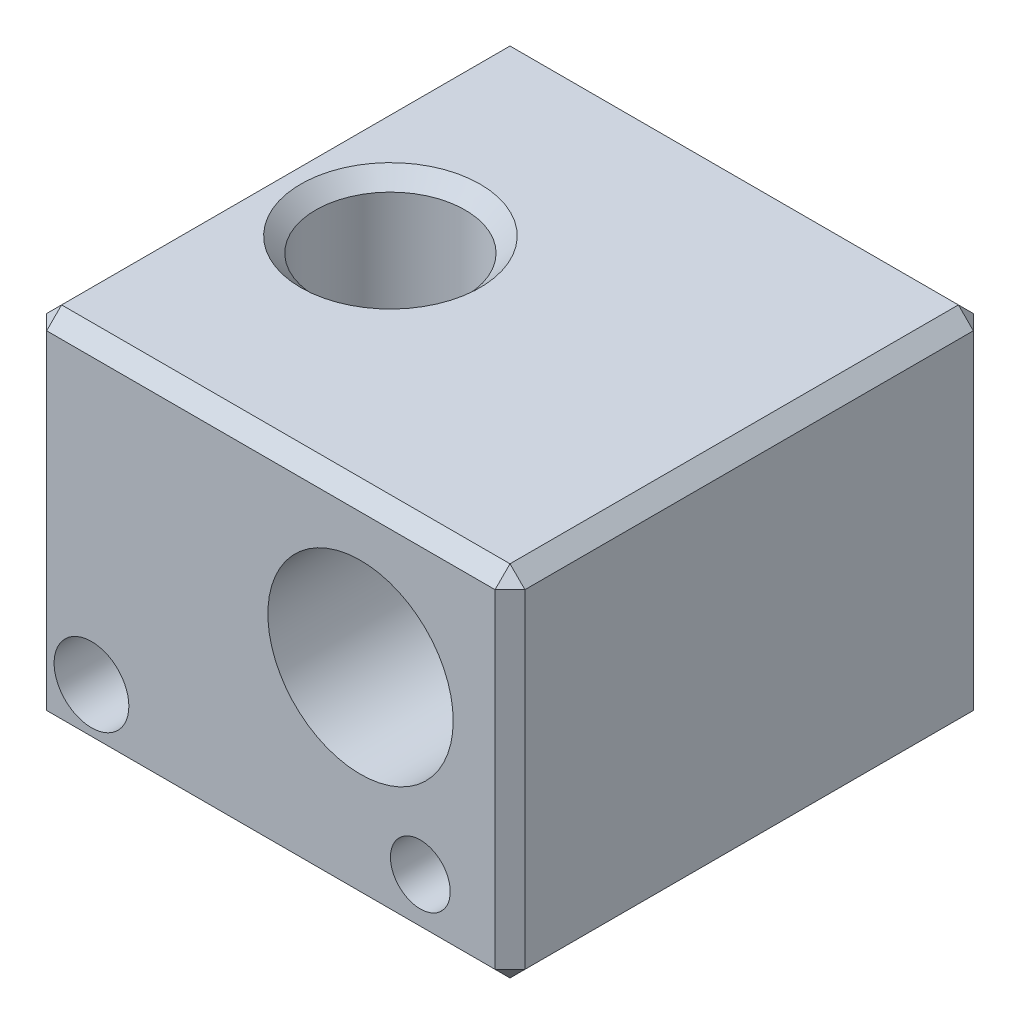
ISO-10303-21;
HEADER;
FILE_DESCRIPTION(('STEP AP214'),'2;1');
FILE_NAME('part.step','',(''),(''),'','','');
FILE_SCHEMA(('AUTOMOTIVE_DESIGN { 1 0 10303 214 1 1 1 1 }'));
ENDSEC;
DATA;
#1=APPLICATION_CONTEXT('core data for automotive mechanical design processes');
#2=APPLICATION_PROTOCOL_DEFINITION('international standard','automotive_design',2000,#1);
#3=PRODUCT_CONTEXT('',#1,'mechanical');
#4=PRODUCT('Part','Part','',(#3));
#5=PRODUCT_RELATED_PRODUCT_CATEGORY('part','',(#4));
#6=PRODUCT_DEFINITION_FORMATION('','',#4);
#7=PRODUCT_DEFINITION_CONTEXT('part definition',#1,'design');
#8=PRODUCT_DEFINITION('design','',#6,#7);
#9=PRODUCT_DEFINITION_SHAPE('','',#8);
#10=(LENGTH_UNIT() NAMED_UNIT(*) SI_UNIT(.MILLI.,.METRE.));
#11=(NAMED_UNIT(*) PLANE_ANGLE_UNIT() SI_UNIT($,.RADIAN.));
#12=(NAMED_UNIT(*) SI_UNIT($,.STERADIAN.) SOLID_ANGLE_UNIT());
#13=UNCERTAINTY_MEASURE_WITH_UNIT(LENGTH_MEASURE(1.E-05),#10,'distance_accuracy_value','');
#14=(GEOMETRIC_REPRESENTATION_CONTEXT(3) GLOBAL_UNCERTAINTY_ASSIGNED_CONTEXT((#13)) GLOBAL_UNIT_ASSIGNED_CONTEXT((#10,
#11,#12)) REPRESENTATION_CONTEXT('',''));
#15=CARTESIAN_POINT('',(0.,0.,0.));
#16=DIRECTION('',(0.,0.,1.));
#17=DIRECTION('',(1.,0.,0.));
#18=AXIS2_PLACEMENT_3D('',#15,#16,#17);
#19=CARTESIAN_POINT('',(-8.,12.,8.));
#20=DIRECTION('',(0.,0.,-1.));
#21=DIRECTION('',(-1.,0.,0.));
#22=AXIS2_PLACEMENT_3D('',#19,#20,#21);
#23=PLANE('',#22);
#24=DIRECTION('',(0.,-1.,0.));
#25=VECTOR('',#24,1.);
#26=CARTESIAN_POINT('',(-7.49999999999999,0.,8.));
#27=LINE('',#26,#25);
#28=CARTESIAN_POINT('',(-7.49999999999999,11.5,8.));
#29=VERTEX_POINT('',#28);
#30=CARTESIAN_POINT('',(-7.49999999999999,0.500000000000004,8.));
#31=VERTEX_POINT('',#30);
#32=EDGE_CURVE('E365',#29,#31,#27,.T.);
#33=ORIENTED_EDGE('',*,*,#32,.T.);
#34=DIRECTION('',(1.,0.,0.));
#35=VECTOR('',#34,1.);
#36=CARTESIAN_POINT('',(-8.,0.500000000000004,8.));
#37=LINE('',#36,#35);
#38=CARTESIAN_POINT('',(7.5,0.500000000000004,8.));
#39=VERTEX_POINT('',#38);
#40=EDGE_CURVE('E373',#31,#39,#37,.T.);
#41=ORIENTED_EDGE('',*,*,#40,.T.);
#42=DIRECTION('',(0.,1.,0.));
#43=VECTOR('',#42,1.);
#44=CARTESIAN_POINT('',(7.5,12.,8.));
#45=LINE('',#44,#43);
#46=CARTESIAN_POINT('',(7.5,11.5,8.));
#47=VERTEX_POINT('',#46);
#48=EDGE_CURVE('E355',#39,#47,#45,.T.);
#49=ORIENTED_EDGE('',*,*,#48,.T.);
#50=DIRECTION('',(-1.,0.,0.));
#51=VECTOR('',#50,1.);
#52=CARTESIAN_POINT('',(-8.,11.5,8.));
#53=LINE('',#52,#51);
#54=EDGE_CURVE('E361',#47,#29,#53,.T.);
#55=ORIENTED_EDGE('',*,*,#54,.T.);
#56=EDGE_LOOP('',(#33,#41,#49,#55));
#57=FACE_BOUND('',#56,.T.);
#58=CARTESIAN_POINT('',(-6.,2.,8.));
#59=DIRECTION('',(0.,0.,1.));
#60=DIRECTION('',(1.,0.,0.));
#61=AXIS2_PLACEMENT_3D('',#58,#59,#60);
#62=CIRCLE('',#61,1.25);
#63=CARTESIAN_POINT('',(-4.75,2.,8.));
#64=VERTEX_POINT('',#63);
#65=EDGE_CURVE('E233',#64,#64,#62,.T.);
#66=ORIENTED_EDGE('',*,*,#65,.F.);
#67=EDGE_LOOP('',(#66));
#68=FACE_BOUND('',#67,.T.);
#69=CARTESIAN_POINT('',(5.,2.,8.));
#70=DIRECTION('',(0.,0.,1.));
#71=DIRECTION('',(1.,0.,0.));
#72=AXIS2_PLACEMENT_3D('',#69,#70,#71);
#73=CIRCLE('',#72,1.);
#74=CARTESIAN_POINT('',(6.,2.,8.));
#75=VERTEX_POINT('',#74);
#76=EDGE_CURVE('E430',#75,#75,#73,.T.);
#77=ORIENTED_EDGE('',*,*,#76,.F.);
#78=EDGE_LOOP('',(#77));
#79=FACE_BOUND('',#78,.T.);
#80=CARTESIAN_POINT('',(3.,7.,8.));
#81=DIRECTION('',(0.,0.,1.));
#82=DIRECTION('',(1.,0.,0.));
#83=AXIS2_PLACEMENT_3D('',#80,#81,#82);
#84=CIRCLE('',#83,3.1);
#85=CARTESIAN_POINT('',(6.1,7.,8.));
#86=VERTEX_POINT('',#85);
#87=EDGE_CURVE('E424',#86,#86,#84,.T.);
#88=ORIENTED_EDGE('',*,*,#87,.F.);
#89=EDGE_LOOP('',(#88));
#90=FACE_BOUND('',#89,.T.);
#91=ADVANCED_FACE('F44',(#57,#68,#79,#90),#23,.F.);
#92=CARTESIAN_POINT('',(8.,12.,8.));
#93=DIRECTION('',(-1.,0.,0.));
#94=DIRECTION('',(0.,0.,1.));
#95=AXIS2_PLACEMENT_3D('',#92,#93,#94);
#96=PLANE('',#95);
#97=DIRECTION('',(0.,0.,1.));
#98=VECTOR('',#97,1.);
#99=CARTESIAN_POINT('',(8.,11.5,8.));
#100=LINE('',#99,#98);
#101=CARTESIAN_POINT('',(8.,11.5,-7.5));
#102=VERTEX_POINT('',#101);
#103=CARTESIAN_POINT('',(8.,11.5,7.5));
#104=VERTEX_POINT('',#103);
#105=EDGE_CURVE('E375',#102,#104,#100,.T.);
#106=ORIENTED_EDGE('',*,*,#105,.T.);
#107=DIRECTION('',(0.,-1.,0.));
#108=VECTOR('',#107,1.);
#109=CARTESIAN_POINT('',(8.,12.,7.5));
#110=LINE('',#109,#108);
#111=CARTESIAN_POINT('',(8.,0.5,7.5));
#112=VERTEX_POINT('',#111);
#113=EDGE_CURVE('E357',#104,#112,#110,.T.);
#114=ORIENTED_EDGE('',*,*,#113,.T.);
#115=DIRECTION('',(0.,0.,-1.));
#116=VECTOR('',#115,1.);
#117=CARTESIAN_POINT('',(8.,0.5,8.));
#118=LINE('',#117,#116);
#119=CARTESIAN_POINT('',(8.,0.5,-7.5));
#120=VERTEX_POINT('',#119);
#121=EDGE_CURVE('E379',#112,#120,#118,.T.);
#122=ORIENTED_EDGE('',*,*,#121,.T.);
#123=DIRECTION('',(0.,1.,0.));
#124=VECTOR('',#123,1.);
#125=CARTESIAN_POINT('',(8.,12.,-7.5));
#126=LINE('',#125,#124);
#127=EDGE_CURVE('E377',#120,#102,#126,.T.);
#128=ORIENTED_EDGE('',*,*,#127,.T.);
#129=EDGE_LOOP('',(#106,#114,#122,#128));
#130=FACE_BOUND('',#129,.T.);
#131=ADVANCED_FACE('F265',(#130),#96,.F.);
#132=CARTESIAN_POINT('',(-8.,12.,-8.));
#133=DIRECTION('',(0.,0.,-1.));
#134=DIRECTION('',(-1.,0.,0.));
#135=AXIS2_PLACEMENT_3D('',#132,#133,#134);
#136=PLANE('',#135);
#137=DIRECTION('',(-1.,0.,0.));
#138=VECTOR('',#137,1.);
#139=CARTESIAN_POINT('',(-8.,0.500000000000004,-8.));
#140=LINE('',#139,#138);
#141=CARTESIAN_POINT('',(7.5,0.500000000000004,-8.));
#142=VERTEX_POINT('',#141);
#143=CARTESIAN_POINT('',(-7.49999999999999,0.500000000000004,-8.));
#144=VERTEX_POINT('',#143);
#145=EDGE_CURVE('E368',#142,#144,#140,.T.);
#146=ORIENTED_EDGE('',*,*,#145,.T.);
#147=DIRECTION('',(0.,1.,0.));
#148=VECTOR('',#147,1.);
#149=CARTESIAN_POINT('',(-7.49999999999999,12.,-8.));
#150=LINE('',#149,#148);
#151=CARTESIAN_POINT('',(-7.49999999999999,11.5,-8.));
#152=VERTEX_POINT('',#151);
#153=EDGE_CURVE('E363',#144,#152,#150,.T.);
#154=ORIENTED_EDGE('',*,*,#153,.T.);
#155=DIRECTION('',(1.,0.,0.));
#156=VECTOR('',#155,1.);
#157=CARTESIAN_POINT('',(-8.,11.5,-8.));
#158=LINE('',#157,#156);
#159=CARTESIAN_POINT('',(7.5,11.5,-8.));
#160=VERTEX_POINT('',#159);
#161=EDGE_CURVE('E394',#152,#160,#158,.T.);
#162=ORIENTED_EDGE('',*,*,#161,.T.);
#163=DIRECTION('',(0.,-1.,0.));
#164=VECTOR('',#163,1.);
#165=CARTESIAN_POINT('',(7.5,0.,-8.));
#166=LINE('',#165,#164);
#167=EDGE_CURVE('E396',#160,#142,#166,.T.);
#168=ORIENTED_EDGE('',*,*,#167,.T.);
#169=EDGE_LOOP('',(#146,#154,#162,#168));
#170=FACE_BOUND('',#169,.T.);
#171=CARTESIAN_POINT('',(5.,2.,-8.));
#172=DIRECTION('',(0.,0.,1.));
#173=DIRECTION('',(1.,0.,0.));
#174=AXIS2_PLACEMENT_3D('',#171,#172,#173);
#175=CIRCLE('',#174,1.);
#176=CARTESIAN_POINT('',(6.,2.,-8.));
#177=VERTEX_POINT('',#176);
#178=EDGE_CURVE('E427',#177,#177,#175,.T.);
#179=ORIENTED_EDGE('',*,*,#178,.T.);
#180=EDGE_LOOP('',(#179));
#181=FACE_BOUND('',#180,.T.);
#182=CARTESIAN_POINT('',(3.,7.,-8.));
#183=DIRECTION('',(0.,0.,1.));
#184=DIRECTION('',(1.,0.,0.));
#185=AXIS2_PLACEMENT_3D('',#182,#183,#184);
#186=CIRCLE('',#185,3.1);
#187=CARTESIAN_POINT('',(6.1,7.,-8.));
#188=VERTEX_POINT('',#187);
#189=EDGE_CURVE('E154',#188,#188,#186,.T.);
#190=ORIENTED_EDGE('',*,*,#189,.T.);
#191=EDGE_LOOP('',(#190));
#192=FACE_BOUND('',#191,.T.);
#193=ADVANCED_FACE('F271',(#170,#181,#192),#136,.T.);
#194=CARTESIAN_POINT('',(-8.,12.,8.));
#195=DIRECTION('',(-1.,0.,0.));
#196=DIRECTION('',(0.,0.,1.));
#197=AXIS2_PLACEMENT_3D('',#194,#195,#196);
#198=PLANE('',#197);
#199=DIRECTION('',(0.,-1.,0.));
#200=VECTOR('',#199,1.);
#201=CARTESIAN_POINT('',(-8.,12.,-7.5));
#202=LINE('',#201,#200);
#203=CARTESIAN_POINT('',(-8.,11.5,-7.5));
#204=VERTEX_POINT('',#203);
#205=CARTESIAN_POINT('',(-8.,0.500000000000004,-7.5));
#206=VERTEX_POINT('',#205);
#207=EDGE_CURVE('E389',#204,#206,#202,.T.);
#208=ORIENTED_EDGE('',*,*,#207,.T.);
#209=DIRECTION('',(0.,0.,1.));
#210=VECTOR('',#209,1.);
#211=CARTESIAN_POINT('',(-8.,0.500000000000004,8.));
#212=LINE('',#211,#210);
#213=CARTESIAN_POINT('',(-8.,0.500000000000004,7.5));
#214=VERTEX_POINT('',#213);
#215=EDGE_CURVE('E160',#206,#214,#212,.T.);
#216=ORIENTED_EDGE('',*,*,#215,.T.);
#217=DIRECTION('',(0.,1.,0.));
#218=VECTOR('',#217,1.);
#219=CARTESIAN_POINT('',(-8.,12.,7.5));
#220=LINE('',#219,#218);
#221=CARTESIAN_POINT('',(-8.,11.5,7.5));
#222=VERTEX_POINT('',#221);
#223=EDGE_CURVE('E403',#214,#222,#220,.T.);
#224=ORIENTED_EDGE('',*,*,#223,.T.);
#225=DIRECTION('',(0.,0.,-1.));
#226=VECTOR('',#225,1.);
#227=CARTESIAN_POINT('',(-8.,11.5,8.));
#228=LINE('',#227,#226);
#229=EDGE_CURVE('E405',#222,#204,#228,.T.);
#230=ORIENTED_EDGE('',*,*,#229,.T.);
#231=EDGE_LOOP('',(#208,#216,#224,#230));
#232=FACE_BOUND('',#231,.T.);
#233=ADVANCED_FACE('F465',(#232),#198,.T.);
#234=CARTESIAN_POINT('',(0.,12.,0.));
#235=DIRECTION('',(0.,1.,0.));
#236=DIRECTION('',(0.,0.,1.));
#237=AXIS2_PLACEMENT_3D('',#234,#235,#236);
#238=PLANE('',#237);
#239=DIRECTION('',(-1.,0.,0.));
#240=VECTOR('',#239,1.);
#241=CARTESIAN_POINT('',(0.,12.,-7.5));
#242=LINE('',#241,#240);
#243=CARTESIAN_POINT('',(7.5,12.,-7.5));
#244=VERTEX_POINT('',#243);
#245=CARTESIAN_POINT('',(-7.5,12.,-7.5));
#246=VERTEX_POINT('',#245);
#247=EDGE_CURVE('E53',#244,#246,#242,.T.);
#248=ORIENTED_EDGE('',*,*,#247,.T.);
#249=DIRECTION('',(0.,0.,1.));
#250=VECTOR('',#249,1.);
#251=CARTESIAN_POINT('',(-7.5,12.,0.));
#252=LINE('',#251,#250);
#253=CARTESIAN_POINT('',(-7.5,12.,7.5));
#254=VERTEX_POINT('',#253);
#255=EDGE_CURVE('E13',#246,#254,#252,.T.);
#256=ORIENTED_EDGE('',*,*,#255,.T.);
#257=DIRECTION('',(1.,0.,0.));
#258=VECTOR('',#257,1.);
#259=CARTESIAN_POINT('',(8.,12.,7.5));
#260=LINE('',#259,#258);
#261=CARTESIAN_POINT('',(7.5,12.,7.5));
#262=VERTEX_POINT('',#261);
#263=EDGE_CURVE('E385',#254,#262,#260,.T.);
#264=ORIENTED_EDGE('',*,*,#263,.T.);
#265=DIRECTION('',(0.,0.,-1.));
#266=VECTOR('',#265,1.);
#267=CARTESIAN_POINT('',(7.5,12.,-8.));
#268=LINE('',#267,#266);
#269=EDGE_CURVE('E64',#262,#244,#268,.T.);
#270=ORIENTED_EDGE('',*,*,#269,.T.);
#271=EDGE_LOOP('',(#248,#256,#264,#270));
#272=FACE_BOUND('',#271,.T.);
#273=CARTESIAN_POINT('',(-4.,12.,0.));
#274=DIRECTION('',(0.,1.,0.));
#275=DIRECTION('',(0.,0.,1.));
#276=AXIS2_PLACEMENT_3D('',#273,#274,#275);
#277=CIRCLE('',#276,2.99999999999999);
#278=CARTESIAN_POINT('',(-4.,12.,2.99999999999999));
#279=VERTEX_POINT('',#278);
#280=EDGE_CURVE('E382',#279,#279,#277,.F.);
#281=ORIENTED_EDGE('',*,*,#280,.T.);
#282=EDGE_LOOP('',(#281));
#283=FACE_BOUND('',#282,.T.);
#284=ADVANCED_FACE('F458',(#272,#283),#238,.T.);
#285=CARTESIAN_POINT('',(0.,0.,0.));
#286=DIRECTION('',(0.,1.,0.));
#287=DIRECTION('',(0.,0.,1.));
#288=AXIS2_PLACEMENT_3D('',#285,#286,#287);
#289=PLANE('',#288);
#290=CARTESIAN_POINT('',(-4.,0.,0.));
#291=DIRECTION('',(0.,1.,0.));
#292=DIRECTION('',(0.,0.,1.));
#293=AXIS2_PLACEMENT_3D('',#290,#291,#292);
#294=CIRCLE('',#293,3.);
#295=CARTESIAN_POINT('',(-4.,0.,3.));
#296=VERTEX_POINT('',#295);
#297=EDGE_CURVE('E415',#296,#296,#294,.T.);
#298=ORIENTED_EDGE('',*,*,#297,.T.);
#299=EDGE_LOOP('',(#298));
#300=FACE_BOUND('',#299,.T.);
#301=CARTESIAN_POINT('',(2.,0.,0.));
#302=DIRECTION('',(0.,1.,0.));
#303=DIRECTION('',(0.,0.,1.));
#304=AXIS2_PLACEMENT_3D('',#301,#302,#303);
#305=CIRCLE('',#304,1.75);
#306=CARTESIAN_POINT('',(2.,0.,1.75));
#307=VERTEX_POINT('',#306);
#308=EDGE_CURVE('E418',#307,#307,#305,.T.);
#309=ORIENTED_EDGE('',*,*,#308,.T.);
#310=EDGE_LOOP('',(#309));
#311=FACE_BOUND('',#310,.T.);
#312=DIRECTION('',(1.,0.,0.));
#313=VECTOR('',#312,1.);
#314=CARTESIAN_POINT('',(8.,0.,-7.5));
#315=LINE('',#314,#313);
#316=CARTESIAN_POINT('',(-7.5,0.,-7.5));
#317=VERTEX_POINT('',#316);
#318=CARTESIAN_POINT('',(7.5,0.,-7.5));
#319=VERTEX_POINT('',#318);
#320=EDGE_CURVE('E136',#317,#319,#315,.T.);
#321=ORIENTED_EDGE('',*,*,#320,.T.);
#322=DIRECTION('',(0.,0.,1.));
#323=VECTOR('',#322,1.);
#324=CARTESIAN_POINT('',(7.5,0.,0.));
#325=LINE('',#324,#323);
#326=CARTESIAN_POINT('',(7.5,0.,7.5));
#327=VERTEX_POINT('',#326);
#328=EDGE_CURVE('E421',#319,#327,#325,.T.);
#329=ORIENTED_EDGE('',*,*,#328,.T.);
#330=DIRECTION('',(-1.,0.,0.));
#331=VECTOR('',#330,1.);
#332=CARTESIAN_POINT('',(0.,0.,7.5));
#333=LINE('',#332,#331);
#334=CARTESIAN_POINT('',(-7.5,0.,7.5));
#335=VERTEX_POINT('',#334);
#336=EDGE_CURVE('E138',#327,#335,#333,.T.);
#337=ORIENTED_EDGE('',*,*,#336,.T.);
#338=DIRECTION('',(0.,0.,-1.));
#339=VECTOR('',#338,1.);
#340=CARTESIAN_POINT('',(-7.5,0.,-8.));
#341=LINE('',#340,#339);
#342=EDGE_CURVE('E132',#335,#317,#341,.T.);
#343=ORIENTED_EDGE('',*,*,#342,.T.);
#344=EDGE_LOOP('',(#321,#329,#337,#343));
#345=FACE_BOUND('',#344,.T.);
#346=ADVANCED_FACE('F134',(#300,#311,#345),#289,.F.);
#347=CARTESIAN_POINT('',(3.,7.,-8.));
#348=DIRECTION('',(0.,0.,1.));
#349=DIRECTION('',(1.,0.,0.));
#350=AXIS2_PLACEMENT_3D('',#347,#348,#349);
#351=CYLINDRICAL_SURFACE('',#350,3.1);
#352=CARTESIAN_POINT('',(2.,4.06571984977576,-1.25));
#353=CARTESIAN_POINT('',(2.06412407102761,4.04386931657047,-1.24999682356544));
#354=CARTESIAN_POINT('',(2.1290323605544,4.02411324985325,-1.24504633684303));
#355=CARTESIAN_POINT('',(2.25852514450525,3.98923249124023,-1.22473081712279));
#356=CARTESIAN_POINT('',(2.32310928391037,3.97411209996811,-1.20935615557821));
#357=CARTESIAN_POINT('',(2.44989951240688,3.94851243111399,-1.16813357100094));
#358=CARTESIAN_POINT('',(2.5121031224863,3.93803787752112,-1.14227503862974));
#359=CARTESIAN_POINT('',(2.63195571275444,3.92132984840443,-1.08059009030169));
#360=CARTESIAN_POINT('',(2.68960522979696,3.9150958723238,-1.04476485151625));
#361=CARTESIAN_POINT('',(2.79749646548957,3.9061553785297,-0.964844569883464));
#362=CARTESIAN_POINT('',(2.84785468706466,3.90338624247298,-0.920913307988026));
#363=CARTESIAN_POINT('',(2.94096515404917,3.9002113379841,-0.825546991201818));
#364=CARTESIAN_POINT('',(2.98371611790489,3.89980596739803,-0.77411067462625));
#365=CARTESIAN_POINT('',(3.06159260293196,3.90035946609992,-0.663497060760644));
#366=CARTESIAN_POINT('',(3.09645925371717,3.90135848340574,-0.604137697597038));
#367=CARTESIAN_POINT('',(3.15599100394901,3.90378325578923,-0.48051332323618));
#368=CARTESIAN_POINT('',(3.18065507855612,3.90520905371185,-0.41624781998927));
#369=CARTESIAN_POINT('',(3.219563460487,3.90772172802315,-0.283004227305716));
#370=CARTESIAN_POINT('',(3.23355335949016,3.90879999521813,-0.213951486933704));
#371=CARTESIAN_POINT('',(3.24975342466547,3.91006624436077,-0.0744708002820152));
#372=CARTESIAN_POINT('',(3.25196372633312,3.91025423654886,-0.0040428698298939));
#373=CARTESIAN_POINT('',(3.24454584579713,3.90965852729883,0.13610331981758));
#374=CARTESIAN_POINT('',(3.23493084752302,3.90887590797932,0.205822282120605));
#375=CARTESIAN_POINT('',(3.20416096316388,3.90669215451381,0.342658473349358));
#376=CARTESIAN_POINT('',(3.18300525336871,3.90529097621996,0.409775516198639));
#377=CARTESIAN_POINT('',(3.12971705925274,3.90260076032698,0.539600864597366));
#378=CARTESIAN_POINT('',(3.09757104261829,3.90131186344619,0.602303619527018));
#379=CARTESIAN_POINT('',(3.02320544748315,3.89986461575388,0.721443742705734));
#380=CARTESIAN_POINT('',(2.98098576274907,3.89970627686539,0.777881044872323));
#381=CARTESIAN_POINT('',(2.88783342606414,3.90168164861602,0.882695629692789));
#382=CARTESIAN_POINT('',(2.83692789470841,3.90380833082803,0.931097102225148));
#383=CARTESIAN_POINT('',(2.72789903274865,3.91148275042813,1.01859946114047));
#384=CARTESIAN_POINT('',(2.6697779427384,3.91702942794207,1.0577032237314));
#385=CARTESIAN_POINT('',(2.55012644860688,3.93224260272356,1.12446031488305));
#386=CARTESIAN_POINT('',(2.48875355593523,3.9417786318946,1.15242580114432));
#387=CARTESIAN_POINT('',(2.36312125667163,3.96545446304068,1.19795912574914));
#388=CARTESIAN_POINT('',(2.29886232190712,3.97959351483077,1.21552865707629));
#389=CARTESIAN_POINT('',(2.17069358533456,4.01226682493206,1.23997912488614));
#390=CARTESIAN_POINT('',(2.10679724119453,4.03072012533362,1.24704113706527));
#391=CARTESIAN_POINT('',(1.98004597127627,4.07183711455998,1.25145005951004));
#392=CARTESIAN_POINT('',(1.91719133547124,4.09450195497261,1.24879430886528));
#393=CARTESIAN_POINT('',(1.79039996352613,4.14486637335437,1.23404889696496));
#394=CARTESIAN_POINT('',(1.72661340015781,4.17278229677925,1.22141881599695));
#395=CARTESIAN_POINT('',(1.60309462789989,4.23172480365729,1.18704722608764));
#396=CARTESIAN_POINT('',(1.54336344063695,4.26275216610093,1.16530343105146));
#397=CARTESIAN_POINT('',(1.42117063361051,4.33113821293562,1.11019217671031));
#398=CARTESIAN_POINT('',(1.35939678232038,4.36879094402457,1.07566592104613));
#399=CARTESIAN_POINT('',(1.24282899693574,4.4451575339971,0.997068324896723));
#400=CARTESIAN_POINT('',(1.18804788503108,4.48387318839118,0.952979839015347));
#401=CARTESIAN_POINT('',(1.07981131798573,4.5652493581044,0.84973208913941));
#402=CARTESIAN_POINT('',(1.02740262887541,4.60778841664885,0.78937125648153));
#403=CARTESIAN_POINT('',(0.933940511899614,4.68803781259185,0.657652699139252));
#404=CARTESIAN_POINT('',(0.892858403867074,4.72576021366949,0.58632347533955));
#405=CARTESIAN_POINT('',(0.837584924562768,4.77855333774515,0.462557639917995));
#406=CARTESIAN_POINT('',(0.819123133548135,4.79676287087563,0.413367344271981));
#407=CARTESIAN_POINT('',(0.78826980528795,4.82773679133903,0.311499179493662));
#408=CARTESIAN_POINT('',(0.77586854424242,4.84050989685295,0.25882705197902));
#409=CARTESIAN_POINT('',(0.757881546309418,4.85918640303962,0.150576807086338));
#410=CARTESIAN_POINT('',(0.752359461653582,4.86502562241385,0.0949764403431551));
#411=CARTESIAN_POINT('',(0.748865472828148,4.86870869109976,-0.0167257193774438));
#412=CARTESIAN_POINT('',(0.75089069399976,4.86655558457313,-0.0728273133239362));
#413=CARTESIAN_POINT('',(0.761578516592351,4.85535245667867,-0.176640207564639));
#414=CARTESIAN_POINT('',(0.769401951034631,4.84717513891782,-0.224540654398175));
#415=CARTESIAN_POINT('',(0.790189830408191,4.82584267352125,-0.318052868932751));
#416=CARTESIAN_POINT('',(0.803158016152508,4.81268390412906,-0.363662944029742));
#417=CARTESIAN_POINT('',(0.840162649243759,4.77603236941032,-0.470880626168048));
#418=CARTESIAN_POINT('',(0.866560750198721,4.75052707780665,-0.530981431141114));
#419=CARTESIAN_POINT('',(0.927112096806266,4.69460608468315,-0.644654810619277));
#420=CARTESIAN_POINT('',(0.96128358816086,4.66417887978581,-0.698211562882469));
#421=CARTESIAN_POINT('',(1.04663268271053,4.59204167799534,-0.812383187083013));
#422=CARTESIAN_POINT('',(1.09990535564506,4.54952185264107,-0.870922323350582));
#423=CARTESIAN_POINT('',(1.21609478271498,4.46368107503741,-0.976818044097293));
#424=CARTESIAN_POINT('',(1.27901991633881,4.42035945574847,-1.02416482064182));
#425=CARTESIAN_POINT('',(1.41392776615344,4.33527163579194,-1.10694157287936));
#426=CARTESIAN_POINT('',(1.48596282556899,4.29351639302137,-1.14229794759976));
#427=CARTESIAN_POINT('',(1.63734346211578,4.21424966883542,-1.19894283194074));
#428=CARTESIAN_POINT('',(1.71666261513442,4.17672386857871,-1.22028006615794));
#429=CARTESIAN_POINT('',(1.83136793930619,4.12848715119251,-1.23902278442863));
#430=CARTESIAN_POINT('',(1.86466000756247,4.11516072866024,-1.2431091379948));
#431=CARTESIAN_POINT('',(1.93189370742814,4.08959773467645,-1.24859903306798));
#432=CARTESIAN_POINT('',(1.96583554893592,4.07736152287063,-1.25000169236203));
#433=CARTESIAN_POINT('',(2.,4.06571984977576,-1.25));
#434=B_SPLINE_CURVE_WITH_KNOTS('',3,(#352,#353,#354,#355,#356,#357,#358,#359,#360,#361,#362,
#363,#364,#365,#366,#367,#368,#369,#370,#371,#372,#373,#374,#375,#376,#377,#378,#379,#380,#381,
#382,#383,#384,#385,#386,#387,#388,#389,#390,#391,#392,#393,#394,#395,#396,#397,#398,#399,#400,
#401,#402,#403,#404,#405,#406,#407,#408,#409,#410,#411,#412,#413,#414,#415,#416,#417,#418,#419,
#420,#421,#422,#423,#424,#425,#426,#427,#428,#429,#430,#431,#432,#433),.UNSPECIFIED.,.T.,.F.,(4,
2,2,2,2,2,2,2,2,2,2,2,2,2,2,2,2,2,2,2,2,2,2,2,2,2,2,2,2,2,2,2,2,2,2,2,2,2,2,2,4),(0.,
0.203106901637013,0.406401664025732,0.609902669700279,0.813379649991945,1.01312353075626,
1.21290102950349,1.41850722043965,1.62413405931888,1.83452067354489,2.04490486778157,
2.25505471888995,2.46521957125866,2.67564413620872,2.88607092032087,3.09585230705912,
3.30556871411916,3.50890505804192,3.71220827947522,3.91196568210335,4.11177778624364,
4.32322687709546,4.53472903986192,4.77426968848165,5.01424344552382,5.28461256836008,
5.55429066399378,5.72053905381196,5.88651982393155,6.05402525513779,6.22146689248854,
6.36849795003851,6.51563611222958,6.72574116876292,6.93634456763189,7.20454767246493,
7.47298494124712,7.74304134015153,8.01215410127126,8.120331198527,8.2285438508205),.UNSPECIFIED.);
#435=CARTESIAN_POINT('',(2.,4.06571984977576,-1.25));
#436=VERTEX_POINT('',#435);
#437=EDGE_CURVE('E227',#436,#436,#434,.T.);
#438=ORIENTED_EDGE('',*,*,#437,.T.);
#439=EDGE_LOOP('',(#438));
#440=FACE_BOUND('',#439,.T.);
#441=ORIENTED_EDGE('',*,*,#189,.F.);
#442=EDGE_LOOP('',(#441));
#443=FACE_BOUND('',#442,.T.);
#444=ORIENTED_EDGE('',*,*,#87,.T.);
#445=EDGE_LOOP('',(#444));
#446=FACE_BOUND('',#445,.T.);
#447=ADVANCED_FACE('F448',(#440,#443,#446),#351,.F.);
#448=CARTESIAN_POINT('',(5.,2.,-8.));
#449=DIRECTION('',(0.,0.,1.));
#450=DIRECTION('',(1.,0.,0.));
#451=AXIS2_PLACEMENT_3D('',#448,#449,#450);
#452=CYLINDRICAL_SURFACE('',#451,1.);
#453=ORIENTED_EDGE('',*,*,#178,.F.);
#454=EDGE_LOOP('',(#453));
#455=FACE_BOUND('',#454,.T.);
#456=ORIENTED_EDGE('',*,*,#76,.T.);
#457=EDGE_LOOP('',(#456));
#458=FACE_BOUND('',#457,.T.);
#459=ADVANCED_FACE('F450',(#455,#458),#452,.F.);
#460=CARTESIAN_POINT('',(-6.,2.,3.5));
#461=DIRECTION('',(0.,0.,-1.));
#462=DIRECTION('',(-1.,0.,0.));
#463=AXIS2_PLACEMENT_3D('',#460,#461,#462);
#464=PLANE('',#463);
#465=CARTESIAN_POINT('',(-6.,2.,3.5));
#466=DIRECTION('',(0.,0.,1.));
#467=DIRECTION('',(1.,0.,0.));
#468=AXIS2_PLACEMENT_3D('',#465,#466,#467);
#469=CIRCLE('',#468,1.25);
#470=CARTESIAN_POINT('',(-4.75,2.,3.5));
#471=VERTEX_POINT('',#470);
#472=EDGE_CURVE('E238',#471,#471,#469,.T.);
#473=ORIENTED_EDGE('',*,*,#472,.T.);
#474=EDGE_LOOP('',(#473));
#475=FACE_BOUND('',#474,.T.);
#476=ADVANCED_FACE('F437',(#475),#464,.F.);
#477=CARTESIAN_POINT('',(-6.,2.,8.));
#478=DIRECTION('',(0.,0.,1.));
#479=DIRECTION('',(1.,0.,0.));
#480=AXIS2_PLACEMENT_3D('',#477,#478,#479);
#481=CYLINDRICAL_SURFACE('',#480,1.25);
#482=ORIENTED_EDGE('',*,*,#472,.F.);
#483=EDGE_LOOP('',(#482));
#484=FACE_BOUND('',#483,.T.);
#485=ORIENTED_EDGE('',*,*,#65,.T.);
#486=EDGE_LOOP('',(#485));
#487=FACE_BOUND('',#486,.T.);
#488=ADVANCED_FACE('F260',(#484,#487),#481,.F.);
#489=CARTESIAN_POINT('',(-4.,12.,0.));
#490=DIRECTION('',(0.,1.,0.));
#491=DIRECTION('',(0.,0.,1.));
#492=AXIS2_PLACEMENT_3D('',#489,#490,#491);
#493=CYLINDRICAL_SURFACE('',#492,2.49999999999999);
#494=CARTESIAN_POINT('',(-4.,0.500000000000007,0.));
#495=DIRECTION('',(0.,1.,0.));
#496=DIRECTION('',(0.,0.,1.));
#497=AXIS2_PLACEMENT_3D('',#494,#495,#496);
#498=CIRCLE('',#497,2.49999999999999);
#499=CARTESIAN_POINT('',(-4.,0.500000000000007,2.49999999999999));
#500=VERTEX_POINT('',#499);
#501=EDGE_CURVE('E409',#500,#500,#498,.F.);
#502=ORIENTED_EDGE('',*,*,#501,.T.);
#503=EDGE_LOOP('',(#502));
#504=FACE_BOUND('',#503,.T.);
#505=CARTESIAN_POINT('',(-4.,11.5,0.));
#506=DIRECTION('',(0.,1.,0.));
#507=DIRECTION('',(0.,0.,1.));
#508=AXIS2_PLACEMENT_3D('',#505,#506,#507);
#509=CIRCLE('',#508,2.49999999999999);
#510=CARTESIAN_POINT('',(-4.,11.5,2.49999999999999));
#511=VERTEX_POINT('',#510);
#512=EDGE_CURVE('E412',#511,#511,#509,.T.);
#513=ORIENTED_EDGE('',*,*,#512,.T.);
#514=EDGE_LOOP('',(#513));
#515=FACE_BOUND('',#514,.T.);
#516=ADVANCED_FACE('F251',(#504,#515),#493,.F.);
#517=CARTESIAN_POINT('',(2.,0.,0.));
#518=DIRECTION('',(0.,-1.,0.));
#519=DIRECTION('',(0.,0.,-1.));
#520=AXIS2_PLACEMENT_3D('',#517,#518,#519);
#521=CYLINDRICAL_SURFACE('',#520,1.25);
#522=CARTESIAN_POINT('',(2.,0.499999999999996,0.));
#523=DIRECTION('',(0.,1.,0.));
#524=DIRECTION('',(0.,0.,1.));
#525=AXIS2_PLACEMENT_3D('',#522,#523,#524);
#526=CIRCLE('',#525,1.25);
#527=CARTESIAN_POINT('',(2.,0.499999999999996,1.25));
#528=VERTEX_POINT('',#527);
#529=EDGE_CURVE('E407',#528,#528,#526,.F.);
#530=ORIENTED_EDGE('',*,*,#529,.T.);
#531=EDGE_LOOP('',(#530));
#532=FACE_BOUND('',#531,.T.);
#533=ORIENTED_EDGE('',*,*,#437,.F.);
#534=EDGE_LOOP('',(#533));
#535=FACE_BOUND('',#534,.T.);
#536=ADVANCED_FACE('F247',(#532,#535),#521,.F.);
#537=CARTESIAN_POINT('',(-4.,0.,0.));
#538=DIRECTION('',(0.,-1.,0.));
#539=DIRECTION('',(0.,0.,-1.));
#540=AXIS2_PLACEMENT_3D('',#537,#538,#539);
#541=CONICAL_SURFACE('',#540,3.,0.785398163397445);
#542=ORIENTED_EDGE('',*,*,#501,.F.);
#543=EDGE_LOOP('',(#542));
#544=FACE_BOUND('',#543,.T.);
#545=ORIENTED_EDGE('',*,*,#297,.F.);
#546=EDGE_LOOP('',(#545));
#547=FACE_BOUND('',#546,.T.);
#548=ADVANCED_FACE('F250',(#544,#547),#541,.F.);
#549=CARTESIAN_POINT('',(2.,0.499999999999996,0.));
#550=DIRECTION('',(0.,-1.,0.));
#551=DIRECTION('',(0.,0.,-1.));
#552=AXIS2_PLACEMENT_3D('',#549,#550,#551);
#553=CONICAL_SURFACE('',#552,1.25,0.785398163397451);
#554=ORIENTED_EDGE('',*,*,#308,.F.);
#555=EDGE_LOOP('',(#554));
#556=FACE_BOUND('',#555,.T.);
#557=ORIENTED_EDGE('',*,*,#529,.F.);
#558=EDGE_LOOP('',(#557));
#559=FACE_BOUND('',#558,.T.);
#560=ADVANCED_FACE('F257',(#556,#559),#553,.F.);
#561=CARTESIAN_POINT('',(8.,12.,7.5));
#562=DIRECTION('',(-0.707106781186545,0.,-0.70710678118655));
#563=DIRECTION('',(0.,-1.,0.));
#564=AXIS2_PLACEMENT_3D('',#561,#562,#563);
#565=PLANE('',#564);
#566=DIRECTION('',(-0.70710678118655,0.,0.707106781186545));
#567=VECTOR('',#566,1.);
#568=CARTESIAN_POINT('',(7.5,11.5,8.));
#569=LINE('',#568,#567);
#570=EDGE_CURVE('E48',#47,#104,#569,.F.);
#571=ORIENTED_EDGE('',*,*,#570,.F.);
#572=ORIENTED_EDGE('',*,*,#48,.F.);
#573=DIRECTION('',(0.70710678118655,0.,-0.707106781186545));
#574=VECTOR('',#573,1.);
#575=CARTESIAN_POINT('',(8.,0.5,7.5));
#576=LINE('',#575,#574);
#577=EDGE_CURVE('E220',#112,#39,#576,.F.);
#578=ORIENTED_EDGE('',*,*,#577,.F.);
#579=ORIENTED_EDGE('',*,*,#113,.F.);
#580=EDGE_LOOP('',(#571,#572,#578,#579));
#581=FACE_BOUND('',#580,.T.);
#582=ADVANCED_FACE('F280',(#581),#565,.F.);
#583=CARTESIAN_POINT('',(7.5,11.5,8.));
#584=DIRECTION('',(0.577350269189626,0.577350269189622,0.57735026918963));
#585=DIRECTION('',(0.70710678118655,0.,-0.707106781186545));
#586=AXIS2_PLACEMENT_3D('',#583,#584,#585);
#587=PLANE('',#586);
#588=DIRECTION('',(0.,-0.70710678118655,0.707106781186545));
#589=VECTOR('',#588,1.);
#590=CARTESIAN_POINT('',(7.5,11.5,8.));
#591=LINE('',#590,#589);
#592=EDGE_CURVE('E215',#47,#262,#591,.F.);
#593=ORIENTED_EDGE('',*,*,#592,.F.);
#594=ORIENTED_EDGE('',*,*,#570,.T.);
#595=DIRECTION('',(-0.707106781186545,0.70710678118655,0.));
#596=VECTOR('',#595,1.);
#597=CARTESIAN_POINT('',(7.75,11.75,7.5));
#598=LINE('',#597,#596);
#599=EDGE_CURVE('E218',#262,#104,#598,.F.);
#600=ORIENTED_EDGE('',*,*,#599,.F.);
#601=EDGE_LOOP('',(#593,#594,#600));
#602=FACE_BOUND('',#601,.T.);
#603=ADVANCED_FACE('F347',(#602),#587,.T.);
#604=CARTESIAN_POINT('',(8.,0.5,7.5));
#605=DIRECTION('',(0.577350269189622,-0.577350269189626,0.57735026918963));
#606=DIRECTION('',(0.,-0.70710678118655,-0.707106781186545));
#607=AXIS2_PLACEMENT_3D('',#604,#605,#606);
#608=PLANE('',#607);
#609=DIRECTION('',(-0.70710678118655,-0.707106781186545,0.));
#610=VECTOR('',#609,1.);
#611=CARTESIAN_POINT('',(8.,0.5,7.5));
#612=LINE('',#611,#610);
#613=EDGE_CURVE('E209',#112,#327,#612,.T.);
#614=ORIENTED_EDGE('',*,*,#613,.F.);
#615=ORIENTED_EDGE('',*,*,#577,.T.);
#616=DIRECTION('',(0.,0.70710678118655,0.707106781186545));
#617=VECTOR('',#616,1.);
#618=CARTESIAN_POINT('',(7.5,0.250000000000002,7.75));
#619=LINE('',#618,#617);
#620=EDGE_CURVE('E212',#327,#39,#619,.T.);
#621=ORIENTED_EDGE('',*,*,#620,.F.);
#622=EDGE_LOOP('',(#614,#615,#621));
#623=FACE_BOUND('',#622,.T.);
#624=ADVANCED_FACE('F343',(#623),#608,.T.);
#625=CARTESIAN_POINT('',(7.5,12.,0.));
#626=DIRECTION('',(0.70710678118655,0.707106781186545,0.));
#627=DIRECTION('',(0.,0.,1.));
#628=AXIS2_PLACEMENT_3D('',#625,#626,#627);
#629=PLANE('',#628);
#630=ORIENTED_EDGE('',*,*,#599,.T.);
#631=ORIENTED_EDGE('',*,*,#105,.F.);
#632=DIRECTION('',(0.707106781186545,-0.70710678118655,0.));
#633=VECTOR('',#632,1.);
#634=CARTESIAN_POINT('',(8.,11.5,-7.5));
#635=LINE('',#634,#633);
#636=EDGE_CURVE('E203',#244,#102,#635,.T.);
#637=ORIENTED_EDGE('',*,*,#636,.F.);
#638=ORIENTED_EDGE('',*,*,#269,.F.);
#639=EDGE_LOOP('',(#630,#631,#637,#638));
#640=FACE_BOUND('',#639,.T.);
#641=ADVANCED_FACE('F339',(#640),#629,.T.);
#642=CARTESIAN_POINT('',(0.,12.,7.5));
#643=DIRECTION('',(0.,0.707106781186545,0.70710678118655));
#644=DIRECTION('',(-1.,0.,0.));
#645=AXIS2_PLACEMENT_3D('',#642,#643,#644);
#646=PLANE('',#645);
#647=ORIENTED_EDGE('',*,*,#592,.T.);
#648=ORIENTED_EDGE('',*,*,#263,.F.);
#649=DIRECTION('',(0.,0.70710678118655,-0.707106781186545));
#650=VECTOR('',#649,1.);
#651=CARTESIAN_POINT('',(-7.5,11.75,7.75));
#652=LINE('',#651,#650);
#653=EDGE_CURVE('E200',#29,#254,#652,.T.);
#654=ORIENTED_EDGE('',*,*,#653,.F.);
#655=ORIENTED_EDGE('',*,*,#54,.F.);
#656=EDGE_LOOP('',(#647,#648,#654,#655));
#657=FACE_BOUND('',#656,.T.);
#658=ADVANCED_FACE('F335',(#657),#646,.T.);
#659=CARTESIAN_POINT('',(-7.49999999999999,12.,8.));
#660=DIRECTION('',(-0.707106781186545,0.,0.70710678118655));
#661=DIRECTION('',(0.,1.,0.));
#662=AXIS2_PLACEMENT_3D('',#659,#660,#661);
#663=PLANE('',#662);
#664=DIRECTION('',(-0.70710678118655,0.,-0.707106781186545));
#665=VECTOR('',#664,1.);
#666=CARTESIAN_POINT('',(-7.49999999999999,0.500000000000004,8.));
#667=LINE('',#666,#665);
#668=EDGE_CURVE('E194',#31,#214,#667,.T.);
#669=ORIENTED_EDGE('',*,*,#668,.F.);
#670=ORIENTED_EDGE('',*,*,#32,.F.);
#671=DIRECTION('',(0.70710678118655,0.,0.707106781186545));
#672=VECTOR('',#671,1.);
#673=CARTESIAN_POINT('',(-8.,11.5,7.5));
#674=LINE('',#673,#672);
#675=EDGE_CURVE('E197',#222,#29,#674,.T.);
#676=ORIENTED_EDGE('',*,*,#675,.F.);
#677=ORIENTED_EDGE('',*,*,#223,.F.);
#678=EDGE_LOOP('',(#669,#670,#676,#677));
#679=FACE_BOUND('',#678,.T.);
#680=ADVANCED_FACE('F331',(#679),#663,.T.);
#681=CARTESIAN_POINT('',(-8.,0.500000000000004,8.));
#682=DIRECTION('',(0.,0.707106781186545,-0.70710678118655));
#683=DIRECTION('',(1.,0.,0.));
#684=AXIS2_PLACEMENT_3D('',#681,#682,#683);
#685=PLANE('',#684);
#686=ORIENTED_EDGE('',*,*,#620,.T.);
#687=ORIENTED_EDGE('',*,*,#40,.F.);
#688=DIRECTION('',(0.,-0.70710678118655,-0.707106781186545));
#689=VECTOR('',#688,1.);
#690=CARTESIAN_POINT('',(-7.49999999999999,0.500000000000004,8.));
#691=LINE('',#690,#689);
#692=EDGE_CURVE('E192',#335,#31,#691,.F.);
#693=ORIENTED_EDGE('',*,*,#692,.F.);
#694=ORIENTED_EDGE('',*,*,#336,.F.);
#695=EDGE_LOOP('',(#686,#687,#693,#694));
#696=FACE_BOUND('',#695,.T.);
#697=ADVANCED_FACE('F327',(#696),#685,.F.);
#698=CARTESIAN_POINT('',(8.,0.5,8.));
#699=DIRECTION('',(-0.707106781186545,0.70710678118655,0.));
#700=DIRECTION('',(0.,0.,-1.));
#701=AXIS2_PLACEMENT_3D('',#698,#699,#700);
#702=PLANE('',#701);
#703=ORIENTED_EDGE('',*,*,#613,.T.);
#704=ORIENTED_EDGE('',*,*,#328,.F.);
#705=DIRECTION('',(0.70710678118655,0.707106781186545,0.));
#706=VECTOR('',#705,1.);
#707=CARTESIAN_POINT('',(8.,0.5,-7.5));
#708=LINE('',#707,#706);
#709=EDGE_CURVE('E189',#120,#319,#708,.F.);
#710=ORIENTED_EDGE('',*,*,#709,.F.);
#711=ORIENTED_EDGE('',*,*,#121,.F.);
#712=EDGE_LOOP('',(#703,#704,#710,#711));
#713=FACE_BOUND('',#712,.T.);
#714=ADVANCED_FACE('F323',(#713),#702,.F.);
#715=CARTESIAN_POINT('',(7.5,12.,-8.));
#716=DIRECTION('',(0.70710678118655,0.,-0.707106781186545));
#717=DIRECTION('',(0.,1.,0.));
#718=AXIS2_PLACEMENT_3D('',#715,#716,#717);
#719=PLANE('',#718);
#720=DIRECTION('',(-0.707106781186545,0.,-0.70710678118655));
#721=VECTOR('',#720,1.);
#722=CARTESIAN_POINT('',(8.,11.5,-7.5));
#723=LINE('',#722,#721);
#724=EDGE_CURVE('E206',#102,#160,#723,.T.);
#725=ORIENTED_EDGE('',*,*,#724,.F.);
#726=ORIENTED_EDGE('',*,*,#127,.F.);
#727=DIRECTION('',(0.707106781186545,0.,0.70710678118655));
#728=VECTOR('',#727,1.);
#729=CARTESIAN_POINT('',(8.,0.5,-7.5));
#730=LINE('',#729,#728);
#731=EDGE_CURVE('E186',#142,#120,#730,.T.);
#732=ORIENTED_EDGE('',*,*,#731,.F.);
#733=ORIENTED_EDGE('',*,*,#167,.F.);
#734=EDGE_LOOP('',(#725,#726,#732,#733));
#735=FACE_BOUND('',#734,.T.);
#736=ADVANCED_FACE('F319',(#735),#719,.T.);
#737=CARTESIAN_POINT('',(8.,11.5,-7.5));
#738=DIRECTION('',(0.57735026918963,0.577350269189622,-0.577350269189626));
#739=DIRECTION('',(-0.707106781186545,0.,-0.70710678118655));
#740=AXIS2_PLACEMENT_3D('',#737,#738,#739);
#741=PLANE('',#740);
#742=ORIENTED_EDGE('',*,*,#636,.T.);
#743=ORIENTED_EDGE('',*,*,#724,.T.);
#744=DIRECTION('',(0.,-0.70710678118655,-0.707106781186545));
#745=VECTOR('',#744,1.);
#746=CARTESIAN_POINT('',(7.5,11.75,-7.75));
#747=LINE('',#746,#745);
#748=EDGE_CURVE('E183',#244,#160,#747,.T.);
#749=ORIENTED_EDGE('',*,*,#748,.F.);
#750=EDGE_LOOP('',(#742,#743,#749));
#751=FACE_BOUND('',#750,.T.);
#752=ADVANCED_FACE('F315',(#751),#741,.T.);
#753=CARTESIAN_POINT('',(-8.,11.5,7.5));
#754=DIRECTION('',(-0.577350269189626,0.577350269189622,0.57735026918963));
#755=DIRECTION('',(0.70710678118655,0.,0.707106781186545));
#756=AXIS2_PLACEMENT_3D('',#753,#754,#755);
#757=PLANE('',#756);
#758=ORIENTED_EDGE('',*,*,#675,.T.);
#759=ORIENTED_EDGE('',*,*,#653,.T.);
#760=DIRECTION('',(0.707106781186545,0.70710678118655,0.));
#761=VECTOR('',#760,1.);
#762=CARTESIAN_POINT('',(-8.,11.5,7.5));
#763=LINE('',#762,#761);
#764=EDGE_CURVE('E181',#222,#254,#763,.T.);
#765=ORIENTED_EDGE('',*,*,#764,.F.);
#766=EDGE_LOOP('',(#758,#759,#765));
#767=FACE_BOUND('',#766,.T.);
#768=ADVANCED_FACE('F311',(#767),#757,.T.);
#769=CARTESIAN_POINT('',(-7.49999999999999,0.500000000000004,8.));
#770=DIRECTION('',(-0.577350269189626,-0.577350269189622,0.57735026918963));
#771=DIRECTION('',(0.70710678118655,0.,0.707106781186545));
#772=AXIS2_PLACEMENT_3D('',#769,#770,#771);
#773=PLANE('',#772);
#774=ORIENTED_EDGE('',*,*,#692,.T.);
#775=ORIENTED_EDGE('',*,*,#668,.T.);
#776=DIRECTION('',(0.707106781186545,-0.70710678118655,0.));
#777=VECTOR('',#776,1.);
#778=CARTESIAN_POINT('',(-7.75,0.250000000000002,7.5));
#779=LINE('',#778,#777);
#780=EDGE_CURVE('E179',#335,#214,#779,.F.);
#781=ORIENTED_EDGE('',*,*,#780,.F.);
#782=EDGE_LOOP('',(#774,#775,#781));
#783=FACE_BOUND('',#782,.T.);
#784=ADVANCED_FACE('F307',(#783),#773,.T.);
#785=CARTESIAN_POINT('',(8.,0.5,-7.5));
#786=DIRECTION('',(0.577350269189626,-0.577350269189626,-0.577350269189626));
#787=DIRECTION('',(-0.707106781186548,0.,-0.707106781186547));
#788=AXIS2_PLACEMENT_3D('',#785,#786,#787);
#789=PLANE('',#788);
#790=ORIENTED_EDGE('',*,*,#731,.T.);
#791=ORIENTED_EDGE('',*,*,#709,.T.);
#792=DIRECTION('',(0.,0.70710678118655,-0.707106781186545));
#793=VECTOR('',#792,1.);
#794=CARTESIAN_POINT('',(7.5,0.250000000000002,-7.75));
#795=LINE('',#794,#793);
#796=EDGE_CURVE('E153',#142,#319,#795,.F.);
#797=ORIENTED_EDGE('',*,*,#796,.F.);
#798=EDGE_LOOP('',(#790,#791,#797));
#799=FACE_BOUND('',#798,.T.);
#800=ADVANCED_FACE('F303',(#799),#789,.T.);
#801=CARTESIAN_POINT('',(-8.,11.5,-8.));
#802=DIRECTION('',(0.,-0.707106781186545,0.70710678118655));
#803=DIRECTION('',(1.,0.,0.));
#804=AXIS2_PLACEMENT_3D('',#801,#802,#803);
#805=PLANE('',#804);
#806=ORIENTED_EDGE('',*,*,#748,.T.);
#807=ORIENTED_EDGE('',*,*,#161,.F.);
#808=DIRECTION('',(0.,0.70710678118655,0.707106781186545));
#809=VECTOR('',#808,1.);
#810=CARTESIAN_POINT('',(-7.49999999999999,11.5,-8.));
#811=LINE('',#810,#809);
#812=EDGE_CURVE('E175',#246,#152,#811,.F.);
#813=ORIENTED_EDGE('',*,*,#812,.F.);
#814=ORIENTED_EDGE('',*,*,#247,.F.);
#815=EDGE_LOOP('',(#806,#807,#813,#814));
#816=FACE_BOUND('',#815,.T.);
#817=ADVANCED_FACE('F299',(#816),#805,.F.);
#818=CARTESIAN_POINT('',(-8.,11.5,8.));
#819=DIRECTION('',(0.70710678118655,-0.707106781186545,0.));
#820=DIRECTION('',(0.,0.,-1.));
#821=AXIS2_PLACEMENT_3D('',#818,#819,#820);
#822=PLANE('',#821);
#823=ORIENTED_EDGE('',*,*,#764,.T.);
#824=ORIENTED_EDGE('',*,*,#255,.F.);
#825=DIRECTION('',(-0.707106781186545,-0.70710678118655,0.));
#826=VECTOR('',#825,1.);
#827=CARTESIAN_POINT('',(-7.75,11.75,-7.5));
#828=LINE('',#827,#826);
#829=EDGE_CURVE('E164',#204,#246,#828,.F.);
#830=ORIENTED_EDGE('',*,*,#829,.F.);
#831=ORIENTED_EDGE('',*,*,#229,.F.);
#832=EDGE_LOOP('',(#823,#824,#830,#831));
#833=FACE_BOUND('',#832,.T.);
#834=ADVANCED_FACE('F296',(#833),#822,.F.);
#835=CARTESIAN_POINT('',(-7.5,0.,0.));
#836=DIRECTION('',(-0.70710678118655,-0.707106781186545,0.));
#837=DIRECTION('',(0.,0.,1.));
#838=AXIS2_PLACEMENT_3D('',#835,#836,#837);
#839=PLANE('',#838);
#840=ORIENTED_EDGE('',*,*,#780,.T.);
#841=ORIENTED_EDGE('',*,*,#215,.F.);
#842=DIRECTION('',(-0.707106781186545,0.70710678118655,0.));
#843=VECTOR('',#842,1.);
#844=CARTESIAN_POINT('',(-8.,0.500000000000004,-7.5));
#845=LINE('',#844,#843);
#846=EDGE_CURVE('E158',#317,#206,#845,.T.);
#847=ORIENTED_EDGE('',*,*,#846,.F.);
#848=ORIENTED_EDGE('',*,*,#342,.F.);
#849=EDGE_LOOP('',(#840,#841,#847,#848));
#850=FACE_BOUND('',#849,.T.);
#851=ADVANCED_FACE('F159',(#850),#839,.T.);
#852=CARTESIAN_POINT('',(0.,0.,-7.5));
#853=DIRECTION('',(0.,-0.707106781186545,-0.70710678118655));
#854=DIRECTION('',(-1.,0.,0.));
#855=AXIS2_PLACEMENT_3D('',#852,#853,#854);
#856=PLANE('',#855);
#857=ORIENTED_EDGE('',*,*,#796,.T.);
#858=ORIENTED_EDGE('',*,*,#320,.F.);
#859=DIRECTION('',(0.,-0.70710678118655,0.707106781186545));
#860=VECTOR('',#859,1.);
#861=CARTESIAN_POINT('',(-7.5,0.250000000000002,-7.75));
#862=LINE('',#861,#860);
#863=EDGE_CURVE('E150',#144,#317,#862,.T.);
#864=ORIENTED_EDGE('',*,*,#863,.F.);
#865=ORIENTED_EDGE('',*,*,#145,.F.);
#866=EDGE_LOOP('',(#857,#858,#864,#865));
#867=FACE_BOUND('',#866,.T.);
#868=ADVANCED_FACE('F147',(#867),#856,.T.);
#869=CARTESIAN_POINT('',(-7.49999999999999,11.5,-8.));
#870=DIRECTION('',(-0.577350269189626,0.577350269189622,-0.57735026918963));
#871=DIRECTION('',(-0.70710678118655,0.,0.707106781186545));
#872=AXIS2_PLACEMENT_3D('',#869,#870,#871);
#873=PLANE('',#872);
#874=ORIENTED_EDGE('',*,*,#829,.T.);
#875=ORIENTED_EDGE('',*,*,#812,.T.);
#876=DIRECTION('',(0.70710678118655,0.,-0.707106781186545));
#877=VECTOR('',#876,1.);
#878=CARTESIAN_POINT('',(-7.49999999999999,11.5,-8.));
#879=LINE('',#878,#877);
#880=EDGE_CURVE('E168',#204,#152,#879,.T.);
#881=ORIENTED_EDGE('',*,*,#880,.F.);
#882=EDGE_LOOP('',(#874,#875,#881));
#883=FACE_BOUND('',#882,.T.);
#884=ADVANCED_FACE('F288',(#883),#873,.T.);
#885=CARTESIAN_POINT('',(-8.,0.500000000000004,-7.5));
#886=DIRECTION('',(-0.577350269189626,-0.577350269189622,-0.57735026918963));
#887=DIRECTION('',(-0.70710678118655,0.,0.707106781186545));
#888=AXIS2_PLACEMENT_3D('',#885,#886,#887);
#889=PLANE('',#888);
#890=ORIENTED_EDGE('',*,*,#863,.T.);
#891=ORIENTED_EDGE('',*,*,#846,.T.);
#892=DIRECTION('',(-0.70710678118655,0.,0.707106781186545));
#893=VECTOR('',#892,1.);
#894=CARTESIAN_POINT('',(-8.,0.500000000000004,-7.5));
#895=LINE('',#894,#893);
#896=EDGE_CURVE('E167',#144,#206,#895,.T.);
#897=ORIENTED_EDGE('',*,*,#896,.F.);
#898=EDGE_LOOP('',(#890,#891,#897));
#899=FACE_BOUND('',#898,.T.);
#900=ADVANCED_FACE('F166',(#899),#889,.T.);
#901=CARTESIAN_POINT('',(-8.,12.,-7.5));
#902=DIRECTION('',(0.707106781186545,0.,0.70710678118655));
#903=DIRECTION('',(0.,-1.,0.));
#904=AXIS2_PLACEMENT_3D('',#901,#902,#903);
#905=PLANE('',#904);
#906=ORIENTED_EDGE('',*,*,#880,.T.);
#907=ORIENTED_EDGE('',*,*,#153,.F.);
#908=ORIENTED_EDGE('',*,*,#896,.T.);
#909=ORIENTED_EDGE('',*,*,#207,.F.);
#910=EDGE_LOOP('',(#906,#907,#908,#909));
#911=FACE_BOUND('',#910,.T.);
#912=ADVANCED_FACE('F282',(#911),#905,.F.);
#913=CARTESIAN_POINT('',(-4.,11.5,0.));
#914=DIRECTION('',(0.,1.,0.));
#915=DIRECTION('',(0.,0.,1.));
#916=AXIS2_PLACEMENT_3D('',#913,#914,#915);
#917=CONICAL_SURFACE('',#916,2.49999999999999,0.78539816339745);
#918=ORIENTED_EDGE('',*,*,#280,.F.);
#919=EDGE_LOOP('',(#918));
#920=FACE_BOUND('',#919,.T.);
#921=ORIENTED_EDGE('',*,*,#512,.F.);
#922=EDGE_LOOP('',(#921));
#923=FACE_BOUND('',#922,.T.);
#924=ADVANCED_FACE('F46',(#920,#923),#917,.F.);
#925=CLOSED_SHELL('',(#91,#131,#193,#233,#284,#346,#447,#459,#476,#488,#516,#536,#548,#560,#582,
#603,#624,#641,#658,#680,#697,#714,#736,#752,#768,#784,#800,#817,#834,#851,#868,#884,#900,#912,#924));
#926=MANIFOLD_SOLID_BREP('B2',#925);
#927=ADVANCED_BREP_SHAPE_REPRESENTATION('',(#18,#926),#14);
#928=SHAPE_DEFINITION_REPRESENTATION(#9,#927);
ENDSEC;
END-ISO-10303-21;
